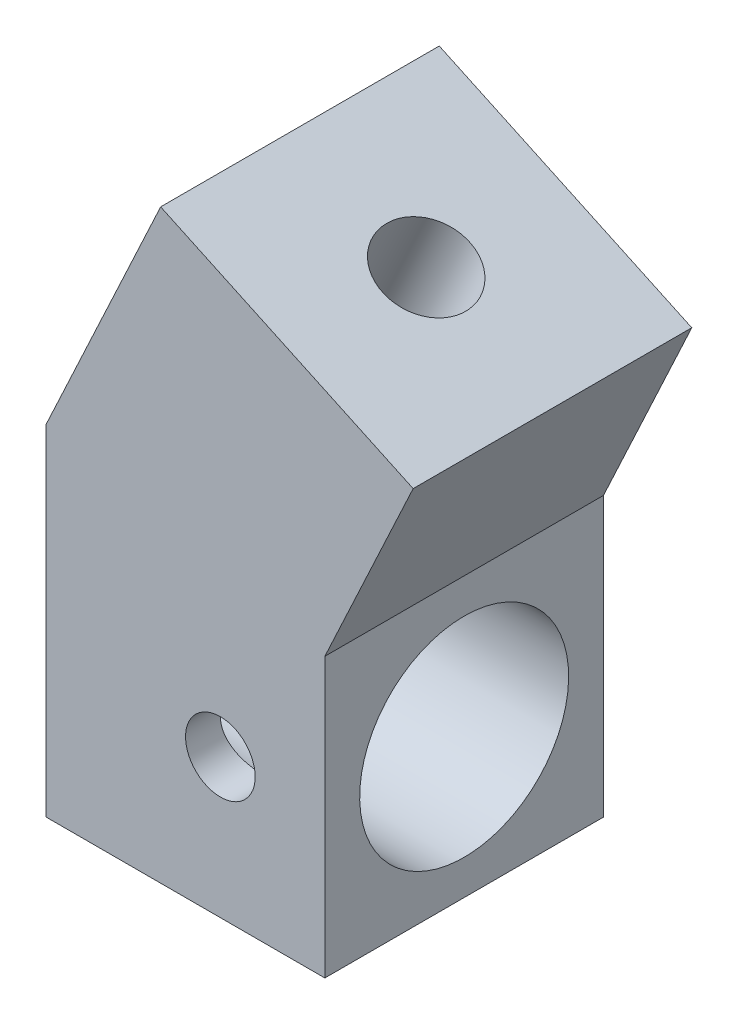
ISO-10303-21;
HEADER;
FILE_DESCRIPTION(('STEP AP214'),'2;1');
FILE_NAME('part.step','',(''),(''),'','','');
FILE_SCHEMA(('AUTOMOTIVE_DESIGN { 1 0 10303 214 1 1 1 1 }'));
ENDSEC;
DATA;
#1=APPLICATION_CONTEXT('core data for automotive mechanical design processes');
#2=APPLICATION_PROTOCOL_DEFINITION('international standard','automotive_design',2000,#1);
#3=PRODUCT_CONTEXT('',#1,'mechanical');
#4=PRODUCT('Part','Part','',(#3));
#5=PRODUCT_RELATED_PRODUCT_CATEGORY('part','',(#4));
#6=PRODUCT_DEFINITION_FORMATION('','',#4);
#7=PRODUCT_DEFINITION_CONTEXT('part definition',#1,'design');
#8=PRODUCT_DEFINITION('design','',#6,#7);
#9=PRODUCT_DEFINITION_SHAPE('','',#8);
#10=(LENGTH_UNIT() NAMED_UNIT(*) SI_UNIT(.MILLI.,.METRE.));
#11=(NAMED_UNIT(*) PLANE_ANGLE_UNIT() SI_UNIT($,.RADIAN.));
#12=(NAMED_UNIT(*) SI_UNIT($,.STERADIAN.) SOLID_ANGLE_UNIT());
#13=UNCERTAINTY_MEASURE_WITH_UNIT(LENGTH_MEASURE(1.E-05),#10,'distance_accuracy_value','');
#14=(GEOMETRIC_REPRESENTATION_CONTEXT(3) GLOBAL_UNCERTAINTY_ASSIGNED_CONTEXT((#13)) GLOBAL_UNIT_ASSIGNED_CONTEXT((#10,
#11,#12)) REPRESENTATION_CONTEXT('',''));
#15=CARTESIAN_POINT('',(0.,0.,0.));
#16=DIRECTION('',(0.,0.,1.));
#17=DIRECTION('',(1.,0.,0.));
#18=AXIS2_PLACEMENT_3D('',#15,#16,#17);
#19=CARTESIAN_POINT('',(0.,0.,8.));
#20=DIRECTION('',(0.,-1.,0.));
#21=DIRECTION('',(1.,0.,0.));
#22=AXIS2_PLACEMENT_3D('',#19,#20,#21);
#23=PLANE('',#22);
#24=DIRECTION('',(-1.,0.,0.));
#25=VECTOR('',#24,1.);
#26=CARTESIAN_POINT('',(0.,0.,0.));
#27=LINE('',#26,#25);
#28=CARTESIAN_POINT('',(8.,0.,0.));
#29=VERTEX_POINT('',#28);
#30=CARTESIAN_POINT('',(0.,0.,0.));
#31=VERTEX_POINT('',#30);
#32=EDGE_CURVE('E127',#29,#31,#27,.T.);
#33=ORIENTED_EDGE('',*,*,#32,.F.);
#34=DIRECTION('',(0.,0.,-1.));
#35=VECTOR('',#34,1.);
#36=CARTESIAN_POINT('',(8.,0.,8.));
#37=LINE('',#36,#35);
#38=CARTESIAN_POINT('',(8.,0.,8.));
#39=VERTEX_POINT('',#38);
#40=EDGE_CURVE('E11',#39,#29,#37,.T.);
#41=ORIENTED_EDGE('',*,*,#40,.F.);
#42=DIRECTION('',(-1.,0.,0.));
#43=VECTOR('',#42,1.);
#44=CARTESIAN_POINT('',(0.,0.,8.));
#45=LINE('',#44,#43);
#46=CARTESIAN_POINT('',(0.,0.,8.));
#47=VERTEX_POINT('',#46);
#48=EDGE_CURVE('E148',#39,#47,#45,.T.);
#49=ORIENTED_EDGE('',*,*,#48,.T.);
#50=DIRECTION('',(0.,0.,-1.));
#51=VECTOR('',#50,1.);
#52=CARTESIAN_POINT('',(0.,0.,8.));
#53=LINE('',#52,#51);
#54=EDGE_CURVE('E58',#47,#31,#53,.T.);
#55=ORIENTED_EDGE('',*,*,#54,.T.);
#56=EDGE_LOOP('',(#33,#41,#49,#55));
#57=FACE_BOUND('',#56,.T.);
#58=ADVANCED_FACE('F41',(#57),#23,.T.);
#59=CARTESIAN_POINT('',(8.,0.,8.));
#60=DIRECTION('',(1.,0.,0.));
#61=DIRECTION('',(0.,1.,0.));
#62=AXIS2_PLACEMENT_3D('',#59,#60,#61);
#63=PLANE('',#62);
#64=CARTESIAN_POINT('',(8.,4.,4.));
#65=DIRECTION('',(1.,0.,0.));
#66=DIRECTION('',(0.,1.,0.));
#67=AXIS2_PLACEMENT_3D('',#64,#65,#66);
#68=CIRCLE('',#67,3.);
#69=CARTESIAN_POINT('',(8.,7.,4.));
#70=VERTEX_POINT('',#69);
#71=EDGE_CURVE('E131',#70,#70,#68,.T.);
#72=ORIENTED_EDGE('',*,*,#71,.F.);
#73=EDGE_LOOP('',(#72));
#74=FACE_BOUND('',#73,.T.);
#75=DIRECTION('',(0.,-1.,0.));
#76=VECTOR('',#75,1.);
#77=CARTESIAN_POINT('',(8.,0.,0.));
#78=LINE('',#77,#76);
#79=CARTESIAN_POINT('',(8.,8.,0.));
#80=VERTEX_POINT('',#79);
#81=EDGE_CURVE('E130',#80,#29,#78,.T.);
#82=ORIENTED_EDGE('',*,*,#81,.F.);
#83=DIRECTION('',(0.,0.,-1.));
#84=VECTOR('',#83,1.);
#85=CARTESIAN_POINT('',(8.,8.,8.));
#86=LINE('',#85,#84);
#87=CARTESIAN_POINT('',(8.,8.,8.));
#88=VERTEX_POINT('',#87);
#89=EDGE_CURVE('E50',#88,#80,#86,.T.);
#90=ORIENTED_EDGE('',*,*,#89,.F.);
#91=DIRECTION('',(0.,-1.,0.));
#92=VECTOR('',#91,1.);
#93=CARTESIAN_POINT('',(8.,0.,8.));
#94=LINE('',#93,#92);
#95=EDGE_CURVE('E309',#88,#39,#94,.T.);
#96=ORIENTED_EDGE('',*,*,#95,.T.);
#97=ORIENTED_EDGE('',*,*,#40,.T.);
#98=EDGE_LOOP('',(#82,#90,#96,#97));
#99=FACE_BOUND('',#98,.T.);
#100=ADVANCED_FACE('F161',(#74,#99),#63,.T.);
#101=CARTESIAN_POINT('',(3.50697266627023,-1.63532821122207,8.));
#102=DIRECTION('',(0.90630778703665,-0.4226182617407,0.));
#103=DIRECTION('',(0.4226182617407,0.90630778703665,0.));
#104=AXIS2_PLACEMENT_3D('',#101,#102,#103);
#105=PLANE('',#104);
#106=DIRECTION('',(-0.4226182617407,-0.90630778703665,0.));
#107=VECTOR('',#106,1.);
#108=CARTESIAN_POINT('',(3.50697266627023,-1.63532821122207,0.));
#109=LINE('',#108,#107);
#110=CARTESIAN_POINT('',(10.5357095704442,13.4378467222199,0.));
#111=VERTEX_POINT('',#110);
#112=EDGE_CURVE('E135',#111,#80,#109,.T.);
#113=ORIENTED_EDGE('',*,*,#112,.F.);
#114=DIRECTION('',(0.,0.,-1.));
#115=VECTOR('',#114,1.);
#116=CARTESIAN_POINT('',(10.5357095704442,13.4378467222199,8.));
#117=LINE('',#116,#115);
#118=CARTESIAN_POINT('',(10.5357095704442,13.4378467222199,8.));
#119=VERTEX_POINT('',#118);
#120=EDGE_CURVE('E106',#119,#111,#117,.T.);
#121=ORIENTED_EDGE('',*,*,#120,.F.);
#122=DIRECTION('',(-0.4226182617407,-0.90630778703665,0.));
#123=VECTOR('',#122,1.);
#124=CARTESIAN_POINT('',(3.50697266627023,-1.63532821122207,8.));
#125=LINE('',#124,#123);
#126=EDGE_CURVE('E116',#119,#88,#125,.T.);
#127=ORIENTED_EDGE('',*,*,#126,.T.);
#128=ORIENTED_EDGE('',*,*,#89,.T.);
#129=EDGE_LOOP('',(#113,#121,#127,#128));
#130=FACE_BOUND('',#129,.T.);
#131=ADVANCED_FACE('F158',(#130),#105,.T.);
#132=CARTESIAN_POINT('',(7.02873690417396,15.073174933442,8.));
#133=DIRECTION('',(0.4226182617407,0.90630778703665,0.));
#134=DIRECTION('',(-0.90630778703665,0.4226182617407,0.));
#135=AXIS2_PLACEMENT_3D('',#132,#133,#134);
#136=PLANE('',#135);
#137=CARTESIAN_POINT('',(6.91047842229761,15.1283197691827,4.));
#138=DIRECTION('',(0.4226182617407,0.90630778703665,0.));
#139=DIRECTION('',(-0.90630778703665,0.4226182617407,0.));
#140=AXIS2_PLACEMENT_3D('',#137,#138,#139);
#141=CIRCLE('',#140,1.25);
#142=CARTESIAN_POINT('',(5.77759368850179,15.6565925963586,4.));
#143=VERTEX_POINT('',#142);
#144=EDGE_CURVE('E194',#143,#143,#141,.T.);
#145=ORIENTED_EDGE('',*,*,#144,.F.);
#146=EDGE_LOOP('',(#145));
#147=FACE_BOUND('',#146,.T.);
#148=DIRECTION('',(0.90630778703665,-0.4226182617407,0.));
#149=VECTOR('',#148,1.);
#150=CARTESIAN_POINT('',(7.02873690417396,15.073174933442,0.));
#151=LINE('',#150,#149);
#152=CARTESIAN_POINT('',(3.285247274151,16.8187928161455,0.));
#153=VERTEX_POINT('',#152);
#154=EDGE_CURVE('E101',#153,#111,#151,.T.);
#155=ORIENTED_EDGE('',*,*,#154,.F.);
#156=DIRECTION('',(0.,0.,-1.));
#157=VECTOR('',#156,1.);
#158=CARTESIAN_POINT('',(3.285247274151,16.8187928161455,8.));
#159=LINE('',#158,#157);
#160=CARTESIAN_POINT('',(3.285247274151,16.8187928161455,8.));
#161=VERTEX_POINT('',#160);
#162=EDGE_CURVE('E96',#161,#153,#159,.T.);
#163=ORIENTED_EDGE('',*,*,#162,.F.);
#164=DIRECTION('',(0.90630778703665,-0.4226182617407,0.));
#165=VECTOR('',#164,1.);
#166=CARTESIAN_POINT('',(7.02873690417396,15.073174933442,8.));
#167=LINE('',#166,#165);
#168=EDGE_CURVE('E99',#161,#119,#167,.T.);
#169=ORIENTED_EDGE('',*,*,#168,.T.);
#170=ORIENTED_EDGE('',*,*,#120,.T.);
#171=EDGE_LOOP('',(#155,#163,#169,#170));
#172=FACE_BOUND('',#171,.T.);
#173=ADVANCED_FACE('F98',(#147,#172),#136,.T.);
#174=CARTESIAN_POINT('',(-3.74348963002296,1.74561788270353,8.));
#175=DIRECTION('',(-0.90630778703665,0.4226182617407,0.));
#176=DIRECTION('',(-0.4226182617407,-0.90630778703665,0.));
#177=AXIS2_PLACEMENT_3D('',#174,#175,#176);
#178=PLANE('',#177);
#179=DIRECTION('',(0.4226182617407,0.90630778703665,0.));
#180=VECTOR('',#179,1.);
#181=CARTESIAN_POINT('',(-3.74348963002296,1.74561788270353,0.));
#182=LINE('',#181,#180);
#183=CARTESIAN_POINT('',(0.,9.77355730114352,0.));
#184=VERTEX_POINT('',#183);
#185=EDGE_CURVE('E141',#184,#153,#182,.T.);
#186=ORIENTED_EDGE('',*,*,#185,.F.);
#187=DIRECTION('',(0.,0.,-1.));
#188=VECTOR('',#187,1.);
#189=CARTESIAN_POINT('',(0.,9.77355730114352,8.));
#190=LINE('',#189,#188);
#191=CARTESIAN_POINT('',(0.,9.77355730114352,8.));
#192=VERTEX_POINT('',#191);
#193=EDGE_CURVE('E77',#192,#184,#190,.T.);
#194=ORIENTED_EDGE('',*,*,#193,.F.);
#195=DIRECTION('',(0.4226182617407,0.90630778703665,0.));
#196=VECTOR('',#195,1.);
#197=CARTESIAN_POINT('',(-3.74348963002296,1.74561788270353,8.));
#198=LINE('',#197,#196);
#199=EDGE_CURVE('E113',#192,#161,#198,.T.);
#200=ORIENTED_EDGE('',*,*,#199,.T.);
#201=ORIENTED_EDGE('',*,*,#162,.T.);
#202=EDGE_LOOP('',(#186,#194,#200,#201));
#203=FACE_BOUND('',#202,.T.);
#204=ADVANCED_FACE('F119',(#203),#178,.T.);
#205=CARTESIAN_POINT('',(0.,0.,8.));
#206=DIRECTION('',(-1.,0.,0.));
#207=DIRECTION('',(0.,0.,1.));
#208=AXIS2_PLACEMENT_3D('',#205,#206,#207);
#209=PLANE('',#208);
#210=CARTESIAN_POINT('',(0.,4.,4.));
#211=DIRECTION('',(-1.,0.,0.));
#212=DIRECTION('',(0.,0.,1.));
#213=AXIS2_PLACEMENT_3D('',#210,#211,#212);
#214=CIRCLE('',#213,3.);
#215=CARTESIAN_POINT('',(0.,4.,7.));
#216=VERTEX_POINT('',#215);
#217=EDGE_CURVE('E301',#216,#216,#214,.F.);
#218=ORIENTED_EDGE('',*,*,#217,.T.);
#219=EDGE_LOOP('',(#218));
#220=FACE_BOUND('',#219,.T.);
#221=DIRECTION('',(0.,1.,0.));
#222=VECTOR('',#221,1.);
#223=CARTESIAN_POINT('',(0.,0.,0.));
#224=LINE('',#223,#222);
#225=EDGE_CURVE('E144',#31,#184,#224,.T.);
#226=ORIENTED_EDGE('',*,*,#225,.F.);
#227=ORIENTED_EDGE('',*,*,#54,.F.);
#228=DIRECTION('',(0.,1.,0.));
#229=VECTOR('',#228,1.);
#230=CARTESIAN_POINT('',(0.,0.,8.));
#231=LINE('',#230,#229);
#232=EDGE_CURVE('E121',#47,#192,#231,.T.);
#233=ORIENTED_EDGE('',*,*,#232,.T.);
#234=ORIENTED_EDGE('',*,*,#193,.T.);
#235=EDGE_LOOP('',(#226,#227,#233,#234));
#236=FACE_BOUND('',#235,.T.);
#237=ADVANCED_FACE('F164',(#220,#236),#209,.T.);
#238=CARTESIAN_POINT('',(0.,0.,8.));
#239=DIRECTION('',(0.,0.,1.));
#240=DIRECTION('',(1.,0.,0.));
#241=AXIS2_PLACEMENT_3D('',#238,#239,#240);
#242=PLANE('',#241);
#243=CARTESIAN_POINT('',(5.,4.,8.));
#244=DIRECTION('',(0.,0.,1.));
#245=DIRECTION('',(1.,0.,0.));
#246=AXIS2_PLACEMENT_3D('',#243,#244,#245);
#247=CIRCLE('',#246,1.);
#248=CARTESIAN_POINT('',(6.,4.,8.));
#249=VERTEX_POINT('',#248);
#250=EDGE_CURVE('E212',#249,#249,#247,.T.);
#251=ORIENTED_EDGE('',*,*,#250,.F.);
#252=EDGE_LOOP('',(#251));
#253=FACE_BOUND('',#252,.T.);
#254=ORIENTED_EDGE('',*,*,#48,.F.);
#255=ORIENTED_EDGE('',*,*,#95,.F.);
#256=ORIENTED_EDGE('',*,*,#126,.F.);
#257=ORIENTED_EDGE('',*,*,#168,.F.);
#258=ORIENTED_EDGE('',*,*,#199,.F.);
#259=ORIENTED_EDGE('',*,*,#232,.F.);
#260=EDGE_LOOP('',(#254,#255,#256,#257,#258,#259));
#261=FACE_BOUND('',#260,.T.);
#262=ADVANCED_FACE('F111',(#253,#261),#242,.T.);
#263=CARTESIAN_POINT('',(0.,0.,0.));
#264=DIRECTION('',(0.,0.,1.));
#265=DIRECTION('',(1.,0.,0.));
#266=AXIS2_PLACEMENT_3D('',#263,#264,#265);
#267=PLANE('',#266);
#268=ORIENTED_EDGE('',*,*,#32,.T.);
#269=ORIENTED_EDGE('',*,*,#225,.T.);
#270=ORIENTED_EDGE('',*,*,#185,.T.);
#271=ORIENTED_EDGE('',*,*,#154,.T.);
#272=ORIENTED_EDGE('',*,*,#112,.T.);
#273=ORIENTED_EDGE('',*,*,#81,.T.);
#274=EDGE_LOOP('',(#268,#269,#270,#271,#272,#273));
#275=FACE_BOUND('',#274,.T.);
#276=ADVANCED_FACE('F163',(#275),#267,.F.);
#277=CARTESIAN_POINT('',(-0.001000000000001,4.,4.));
#278=DIRECTION('',(1.,0.,0.));
#279=DIRECTION('',(0.,1.,0.));
#280=AXIS2_PLACEMENT_3D('',#277,#278,#279);
#281=CYLINDRICAL_SURFACE('',#280,3.);
#282=CARTESIAN_POINT('',(6.,4.,7.));
#283=CARTESIAN_POINT('',(6.00000025373164,3.94543663711328,7.00000015300943));
#284=CARTESIAN_POINT('',(5.99551973387278,3.89087480546145,6.99849769507545));
#285=CARTESIAN_POINT('',(5.97777089118278,3.78335823912703,6.99265210203281));
#286=CARTESIAN_POINT('',(5.96450165605108,3.73040367188118,6.98830867202153));
#287=CARTESIAN_POINT('',(5.92968075661595,3.62766721049822,6.97725307906443));
#288=CARTESIAN_POINT('',(5.90814293754073,3.57788017411397,6.97054487730853));
#289=CARTESIAN_POINT('',(5.85745882716165,3.48262506319467,6.95544445717342));
#290=CARTESIAN_POINT('',(5.8283110349974,3.43715784304129,6.94705190667778));
#291=CARTESIAN_POINT('',(5.76217419514124,3.35025832497773,6.92914094443005));
#292=CARTESIAN_POINT('',(5.7249687657395,3.30899629970169,6.91959556463785));
#293=CARTESIAN_POINT('',(5.64423284529343,3.23316730729792,6.90060314783121));
#294=CARTESIAN_POINT('',(5.60070096507149,3.19860181451054,6.89115613290549));
#295=CARTESIAN_POINT('',(5.50701488480354,3.13617505777214,6.87313332477274));
#296=CARTESIAN_POINT('',(5.45670626026788,3.10853514177897,6.86459039275688));
#297=CARTESIAN_POINT('',(5.35182390554145,3.06218112612228,6.84975305418601));
#298=CARTESIAN_POINT('',(5.29725148283725,3.04346430261324,6.84345796160746));
#299=CARTESIAN_POINT('',(5.18732677850329,3.01612653849084,6.83411303269377));
#300=CARTESIAN_POINT('',(5.13206279151093,3.00718655172823,6.83096095769611));
#301=CARTESIAN_POINT('',(5.02073624584412,2.99865887666552,6.82795656629508));
#302=CARTESIAN_POINT('',(4.96467393929081,2.99906829839528,6.8281032302273));
#303=CARTESIAN_POINT('',(4.85606336955598,3.00898009629658,6.8315901500818));
#304=CARTESIAN_POINT('',(4.80347159708098,3.01806608683301,6.83478415867533));
#305=CARTESIAN_POINT('',(4.70060658039316,3.04439383715058,6.84376657724551));
#306=CARTESIAN_POINT('',(4.65033361456493,3.06163657340813,6.84955529784108));
#307=CARTESIAN_POINT('',(4.55258725040852,3.10406094193979,6.86317911131249));
#308=CARTESIAN_POINT('',(4.50517197453047,3.12936595129274,6.87104565793117));
#309=CARTESIAN_POINT('',(4.41512909172027,3.18711089369686,6.88792558575726));
#310=CARTESIAN_POINT('',(4.37250287306662,3.219552887636,6.89693929790464));
#311=CARTESIAN_POINT('',(4.29090840183923,3.29265066731776,6.91567329167741));
#312=CARTESIAN_POINT('',(4.25224730549093,3.33364684992369,6.92540589354843));
#313=CARTESIAN_POINT('',(4.1822687333366,3.42166043002994,6.94406938387037));
#314=CARTESIAN_POINT('',(4.1509519618355,3.46867840433919,6.95300019538067));
#315=CARTESIAN_POINT('',(4.09630369976493,3.56805238695373,6.96917107937794));
#316=CARTESIAN_POINT('',(4.07305450865927,3.62045672358366,6.97639350008039));
#317=CARTESIAN_POINT('',(4.03579682604429,3.72873091663549,6.98820567144435));
#318=CARTESIAN_POINT('',(4.02178512457656,3.78459956184505,6.99279633654878));
#319=CARTESIAN_POINT('',(4.00394433397764,3.8956161704707,6.99867627071441));
#320=CARTESIAN_POINT('',(3.99970019082725,3.95069040013516,7.00010001833731));
#321=CARTESIAN_POINT('',(4.00033267359847,4.06077506996024,6.99988902694825));
#322=CARTESIAN_POINT('',(4.00520775997987,4.11578551931965,6.99825480419352));
#323=CARTESIAN_POINT('',(4.02361190773597,4.22251986630426,6.99220024717114));
#324=CARTESIAN_POINT('',(4.03688620604952,4.27429280683486,6.98786198711228));
#325=CARTESIAN_POINT('',(4.0713934444667,4.37485595857956,6.97691846830034));
#326=CARTESIAN_POINT('',(4.09262739946767,4.42364578850856,6.97031292046541));
#327=CARTESIAN_POINT('',(4.1430704318409,4.51828829639332,6.95528931287427));
#328=CARTESIAN_POINT('',(4.1724745932836,4.56402995921733,6.94682814756305));
#329=CARTESIAN_POINT('',(4.23819415001305,4.6500648301354,6.92905253915743));
#330=CARTESIAN_POINT('',(4.27451165603016,4.69035636779489,6.91973783591888));
#331=CARTESIAN_POINT('',(4.35497875100826,4.76625250780701,6.90076847982472));
#332=CARTESIAN_POINT('',(4.39940922693325,4.80156096924849,6.89111761095155));
#333=CARTESIAN_POINT('',(4.4937715678045,4.86425752232085,6.87299973286981));
#334=CARTESIAN_POINT('',(4.5437034786102,4.89164554792084,6.8645327335312));
#335=CARTESIAN_POINT('',(4.64767301530659,4.93759693042336,6.84982391820308));
#336=CARTESIAN_POINT('',(4.70170207924278,4.95617813219777,6.84357760900632));
#337=CARTESIAN_POINT('',(4.81237865012415,4.98389466679216,6.83410832399133));
#338=CARTESIAN_POINT('',(4.86902496543306,4.99303425496124,6.83088398622698));
#339=CARTESIAN_POINT('',(4.98019709601321,5.00127628247038,6.82797858875071));
#340=CARTESIAN_POINT('',(5.03468234025174,5.00087025731093,6.82812400344299));
#341=CARTESIAN_POINT('',(5.14276507489974,4.99124229345488,6.8315126992356));
#342=CARTESIAN_POINT('',(5.19636261795291,4.98202087945889,6.83475579595884));
#343=CARTESIAN_POINT('',(5.30013566301267,4.95537181312698,6.84384524278943));
#344=CARTESIAN_POINT('',(5.35035682500723,4.93810334601488,6.84964098015514));
#345=CARTESIAN_POINT('',(5.44722740693553,4.89597936576038,6.86316398825434));
#346=CARTESIAN_POINT('',(5.49387603118726,4.87112216855398,6.87089168765297));
#347=CARTESIAN_POINT('',(5.58448366992369,4.81326069258325,6.8878282922406));
#348=CARTESIAN_POINT('',(5.62823650189859,4.77994824276453,6.89708711641604));
#349=CARTESIAN_POINT('',(5.70968981338399,4.7066428831357,6.91583356283786));
#350=CARTESIAN_POINT('',(5.74738857568802,4.6666480844515,6.92532124912518));
#351=CARTESIAN_POINT('',(5.81714441228924,4.57924155692067,6.94390030525393));
#352=CARTESIAN_POINT('',(5.84892434775101,4.53160151349972,6.95296181801216));
#353=CARTESIAN_POINT('',(5.90399042885063,4.43135735740663,6.96925991172653));
#354=CARTESIAN_POINT('',(5.92727874592204,4.37875451813235,6.9764969590794));
#355=CARTESIAN_POINT('',(5.96372163248867,4.27249364720097,6.98805515068532));
#356=CARTESIAN_POINT('',(5.97728246626337,4.21898775767641,6.9924921242252));
#357=CARTESIAN_POINT('',(5.99542028067712,4.11032041601025,6.99846407064225));
#358=CARTESIAN_POINT('',(5.99999974349654,4.05515942556875,6.99999984531906));
#359=CARTESIAN_POINT('',(6.,4.,7.));
#360=B_SPLINE_CURVE_WITH_KNOTS('',3,(#282,#283,#284,#285,#286,#287,#288,#289,#290,#291,#292,
#293,#294,#295,#296,#297,#298,#299,#300,#301,#302,#303,#304,#305,#306,#307,#308,#309,#310,#311,
#312,#313,#314,#315,#316,#317,#318,#319,#320,#321,#322,#323,#324,#325,#326,#327,#328,#329,#330,
#331,#332,#333,#334,#335,#336,#337,#338,#339,#340,#341,#342,#343,#344,#345,#346,#347,#348,#349,
#350,#351,#352,#353,#354,#355,#356,#357,#358,#359),.UNSPECIFIED.,.T.,.F.,(4,2,2,2,2,2,2,2,2,2,2,
2,2,2,2,2,2,2,2,2,2,2,2,2,2,2,2,2,2,2,2,2,2,2,2,2,2,2,4),(0.,0.163487106026011,
0.326991185267521,0.490222672870274,0.6534863777991,0.821846842827561,0.990244332875302,
1.1634838482347,1.33667044692833,1.5040192574184,1.67131633987485,1.8309682655128,
1.99063930855482,2.15288171155131,2.31517102558207,2.48593305811367,2.65671145966618,
2.82918405650358,3.00159668877208,3.1665358317517,3.33144713164177,3.49158157978214,
3.65173645284104,3.81610399843736,3.98052180821891,4.15241022880752,4.32430008234997,
4.49584013824416,4.66730284700846,4.82995666056619,4.99260079341185,5.15215587070228,
5.31174638165788,5.47830066681615,5.64490211113589,5.81799660824911,5.99104681142266,
6.15636558363624,6.3216386602795),.UNSPECIFIED.);
#361=CARTESIAN_POINT('',(6.,4.,7.));
#362=VERTEX_POINT('',#361);
#363=EDGE_CURVE('E201',#362,#362,#360,.T.);
#364=ORIENTED_EDGE('',*,*,#363,.F.);
#365=EDGE_LOOP('',(#364));
#366=FACE_BOUND('',#365,.T.);
#367=ORIENTED_EDGE('',*,*,#217,.F.);
#368=EDGE_LOOP('',(#367));
#369=FACE_BOUND('',#368,.T.);
#370=ORIENTED_EDGE('',*,*,#71,.T.);
#371=EDGE_LOOP('',(#370));
#372=FACE_BOUND('',#371,.T.);
#373=ADVANCED_FACE('F239',(#366,#369,#372),#281,.F.);
#374=CARTESIAN_POINT('',(5.,4.,-0.000999999999999265));
#375=DIRECTION('',(0.,0.,1.));
#376=DIRECTION('',(1.,0.,0.));
#377=AXIS2_PLACEMENT_3D('',#374,#375,#376);
#378=CYLINDRICAL_SURFACE('',#377,1.);
#379=ORIENTED_EDGE('',*,*,#250,.T.);
#380=EDGE_LOOP('',(#379));
#381=FACE_BOUND('',#380,.T.);
#382=ORIENTED_EDGE('',*,*,#363,.T.);
#383=EDGE_LOOP('',(#382));
#384=FACE_BOUND('',#383,.T.);
#385=ADVANCED_FACE('F214',(#381,#384),#378,.F.);
#386=CARTESIAN_POINT('',(5.64262363707551,12.4093964080728,4.));
#387=DIRECTION('',(0.4226182617407,0.90630778703665,0.));
#388=DIRECTION('',(-0.90630778703665,0.4226182617407,0.));
#389=AXIS2_PLACEMENT_3D('',#386,#387,#388);
#390=CYLINDRICAL_SURFACE('',#389,1.25);
#391=CARTESIAN_POINT('',(5.64262363707551,12.4093964080728,4.));
#392=DIRECTION('',(0.4226182617407,0.90630778703665,0.));
#393=DIRECTION('',(-0.90630778703665,0.4226182617407,0.));
#394=AXIS2_PLACEMENT_3D('',#391,#392,#393);
#395=CIRCLE('',#394,1.25);
#396=CARTESIAN_POINT('',(4.50973890327969,12.9376692352486,4.));
#397=VERTEX_POINT('',#396);
#398=EDGE_CURVE('E197',#397,#397,#395,.T.);
#399=ORIENTED_EDGE('',*,*,#398,.F.);
#400=EDGE_LOOP('',(#399));
#401=FACE_BOUND('',#400,.T.);
#402=ORIENTED_EDGE('',*,*,#144,.T.);
#403=EDGE_LOOP('',(#402));
#404=FACE_BOUND('',#403,.T.);
#405=ADVANCED_FACE('F219',(#401,#404),#390,.F.);
#406=CARTESIAN_POINT('',(5.64262363707551,12.4093964080728,4.));
#407=DIRECTION('',(0.4226182617407,0.90630778703665,0.));
#408=DIRECTION('',(-0.90630778703665,0.4226182617407,0.));
#409=AXIS2_PLACEMENT_3D('',#406,#407,#408);
#410=PLANE('',#409);
#411=ORIENTED_EDGE('',*,*,#398,.T.);
#412=EDGE_LOOP('',(#411));
#413=FACE_BOUND('',#412,.T.);
#414=ADVANCED_FACE('F222',(#413),#410,.T.);
#415=CLOSED_SHELL('',(#58,#100,#131,#173,#204,#237,#262,#276,#373,#385,#405,#414));
#416=MANIFOLD_SOLID_BREP('B2',#415);
#417=ADVANCED_BREP_SHAPE_REPRESENTATION('',(#18,#416),#14);
#418=SHAPE_DEFINITION_REPRESENTATION(#9,#417);
ENDSEC;
END-ISO-10303-21;
